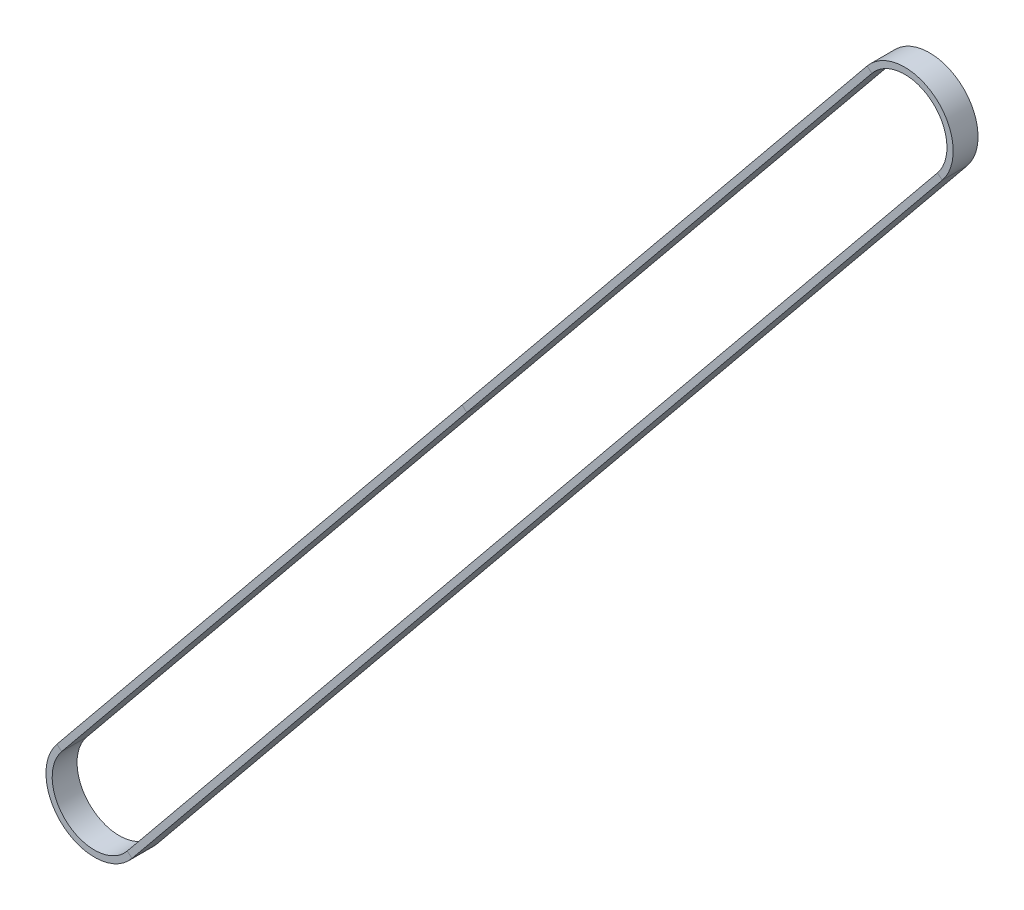
ISO-10303-21;
HEADER;
FILE_DESCRIPTION(('STEP AP214'),'2;1');
FILE_NAME('part.step','',(''),(''),'','','');
FILE_SCHEMA(('AUTOMOTIVE_DESIGN { 1 0 10303 214 1 1 1 1 }'));
ENDSEC;
DATA;
#1=APPLICATION_CONTEXT('core data for automotive mechanical design processes');
#2=APPLICATION_PROTOCOL_DEFINITION('international standard','automotive_design',2000,#1);
#3=PRODUCT_CONTEXT('',#1,'mechanical');
#4=PRODUCT('Part','Part','',(#3));
#5=PRODUCT_RELATED_PRODUCT_CATEGORY('part','',(#4));
#6=PRODUCT_DEFINITION_FORMATION('','',#4);
#7=PRODUCT_DEFINITION_CONTEXT('part definition',#1,'design');
#8=PRODUCT_DEFINITION('design','',#6,#7);
#9=PRODUCT_DEFINITION_SHAPE('','',#8);
#10=(LENGTH_UNIT() NAMED_UNIT(*) SI_UNIT(.MILLI.,.METRE.));
#11=(NAMED_UNIT(*) PLANE_ANGLE_UNIT() SI_UNIT($,.RADIAN.));
#12=(NAMED_UNIT(*) SI_UNIT($,.STERADIAN.) SOLID_ANGLE_UNIT());
#13=UNCERTAINTY_MEASURE_WITH_UNIT(LENGTH_MEASURE(1.E-05),#10,'distance_accuracy_value','');
#14=(GEOMETRIC_REPRESENTATION_CONTEXT(3) GLOBAL_UNCERTAINTY_ASSIGNED_CONTEXT((#13)) GLOBAL_UNIT_ASSIGNED_CONTEXT((#10,
#11,#12)) REPRESENTATION_CONTEXT('',''));
#15=CARTESIAN_POINT('',(0.,0.,0.));
#16=DIRECTION('',(0.,0.,1.));
#17=DIRECTION('',(1.,0.,0.));
#18=AXIS2_PLACEMENT_3D('',#15,#16,#17);
#19=CARTESIAN_POINT('',(-9.06319100841828,7.39922757758679,3.));
#20=DIRECTION('',(0.774631710121228,-0.632412613468977,0.));
#21=DIRECTION('',(0.632412613468977,0.774631710121228,0.));
#22=AXIS2_PLACEMENT_3D('',#19,#20,#21);
#23=PLANE('',#22);
#24=DIRECTION('',(0.,0.,-1.));
#25=VECTOR('',#24,1.);
#26=CARTESIAN_POINT('',(-9.06319100841808,7.39922757758665,3.));
#27=LINE('',#26,#25);
#28=CARTESIAN_POINT('',(-9.06319100841824,7.39922757758678,3.));
#29=VERTEX_POINT('',#28);
#30=CARTESIAN_POINT('',(-9.06319100841824,7.39922757758678,-3.));
#31=VERTEX_POINT('',#30);
#32=EDGE_CURVE('E167',#29,#31,#27,.T.);
#33=ORIENTED_EDGE('',*,*,#32,.F.);
#34=DIRECTION('',(0.632412613468977,0.774631710121228,0.));
#35=VECTOR('',#34,1.);
#36=CARTESIAN_POINT('',(-9.06319100841828,7.39922757758679,3.));
#37=LINE('',#36,#35);
#38=CARTESIAN_POINT('',(88.6807064775247,127.124104739867,3.));
#39=VERTEX_POINT('',#38);
#40=EDGE_CURVE('E166',#29,#39,#37,.T.);
#41=ORIENTED_EDGE('',*,*,#40,.T.);
#42=DIRECTION('',(0.,0.,-1.));
#43=VECTOR('',#42,1.);
#44=CARTESIAN_POINT('',(88.6807064775247,127.124104739867,3.));
#45=LINE('',#44,#43);
#46=CARTESIAN_POINT('',(88.6807064775247,127.124104739867,-3.));
#47=VERTEX_POINT('',#46);
#48=EDGE_CURVE('E141',#39,#47,#45,.T.);
#49=ORIENTED_EDGE('',*,*,#48,.T.);
#50=DIRECTION('',(0.632412613468977,0.774631710121228,0.));
#51=VECTOR('',#50,1.);
#52=CARTESIAN_POINT('',(-9.06319100841828,7.39922757758679,-3.));
#53=LINE('',#52,#51);
#54=EDGE_CURVE('E171',#31,#47,#53,.T.);
#55=ORIENTED_EDGE('',*,*,#54,.F.);
#56=EDGE_LOOP('',(#33,#41,#49,#55));
#57=FACE_BOUND('',#56,.T.);
#58=ADVANCED_FACE('F33',(#57),#23,.F.);
#59=CARTESIAN_POINT('',(88.6807064775247,127.124104739867,3.));
#60=DIRECTION('',(0.774631710121228,-0.632412613468977,0.));
#61=DIRECTION('',(0.632412613468977,0.774631710121228,0.));
#62=AXIS2_PLACEMENT_3D('',#59,#60,#61);
#63=PLANE('',#62);
#64=DIRECTION('',(0.632412613468977,0.774631710121228,0.));
#65=VECTOR('',#64,1.);
#66=CARTESIAN_POINT('',(88.6807064775247,127.124104739867,-3.));
#67=LINE('',#66,#65);
#68=CARTESIAN_POINT('',(186.424603963468,246.848981902148,-3.));
#69=VERTEX_POINT('',#68);
#70=EDGE_CURVE('E147',#47,#69,#67,.T.);
#71=ORIENTED_EDGE('',*,*,#70,.F.);
#72=ORIENTED_EDGE('',*,*,#48,.F.);
#73=DIRECTION('',(0.632412613468977,0.774631710121228,0.));
#74=VECTOR('',#73,1.);
#75=CARTESIAN_POINT('',(88.6807064775247,127.124104739867,3.));
#76=LINE('',#75,#74);
#77=CARTESIAN_POINT('',(186.424603963468,246.848981902148,3.));
#78=VERTEX_POINT('',#77);
#79=EDGE_CURVE('E145',#39,#78,#76,.T.);
#80=ORIENTED_EDGE('',*,*,#79,.T.);
#81=DIRECTION('',(0.,0.,-1.));
#82=VECTOR('',#81,1.);
#83=CARTESIAN_POINT('',(186.424603963468,246.848981902148,3.));
#84=LINE('',#83,#82);
#85=EDGE_CURVE('E163',#78,#69,#84,.T.);
#86=ORIENTED_EDGE('',*,*,#85,.T.);
#87=EDGE_LOOP('',(#71,#72,#80,#86));
#88=FACE_BOUND('',#87,.T.);
#89=ADVANCED_FACE('F143',(#88),#63,.F.);
#90=CARTESIAN_POINT('',(88.6807064775247,127.124104739867,-3.));
#91=DIRECTION('',(0.,0.,1.));
#92=DIRECTION('',(1.,0.,0.));
#93=AXIS2_PLACEMENT_3D('',#90,#91,#92);
#94=PLANE('',#93);
#95=DIRECTION('',(0.632412613468977,0.774631710121228,0.));
#96=VECTOR('',#95,1.);
#97=CARTESIAN_POINT('',(89.8426540427065,126.175485819664,-3.));
#98=LINE('',#97,#96);
#99=CARTESIAN_POINT('',(89.8426540427065,126.175485819664,-3.));
#100=VERTEX_POINT('',#99);
#101=CARTESIAN_POINT('',(187.586551528649,245.900362981944,-3.));
#102=VERTEX_POINT('',#101);
#103=EDGE_CURVE('E212',#100,#102,#98,.T.);
#104=ORIENTED_EDGE('',*,*,#103,.F.);
#105=DIRECTION('',(0.774631710121232,-0.632412613468972,0.));
#106=VECTOR('',#105,1.);
#107=CARTESIAN_POINT('',(88.6807064775247,127.124104739867,-3.));
#108=LINE('',#107,#106);
#109=EDGE_CURVE('E152',#47,#100,#108,.T.);
#110=ORIENTED_EDGE('',*,*,#109,.F.);
#111=ORIENTED_EDGE('',*,*,#70,.T.);
#112=DIRECTION('',(0.774631710121232,-0.632412613468972,0.));
#113=VECTOR('',#112,1.);
#114=CARTESIAN_POINT('',(186.424603963468,246.848981902148,-3.));
#115=LINE('',#114,#113);
#116=EDGE_CURVE('E237',#69,#102,#115,.T.);
#117=ORIENTED_EDGE('',*,*,#116,.T.);
#118=EDGE_LOOP('',(#104,#110,#111,#117));
#119=FACE_BOUND('',#118,.T.);
#120=ADVANCED_FACE('F257',(#119),#94,.F.);
#121=CARTESIAN_POINT('',(89.8426540427065,126.175485819664,3.));
#122=DIRECTION('',(-0.774631710121228,0.632412613468977,0.));
#123=DIRECTION('',(-0.632412613468977,-0.774631710121228,0.));
#124=AXIS2_PLACEMENT_3D('',#121,#122,#123);
#125=PLANE('',#124);
#126=DIRECTION('',(0.632412613468977,0.774631710121228,0.));
#127=VECTOR('',#126,1.);
#128=CARTESIAN_POINT('',(89.8426540427065,126.175485819664,3.));
#129=LINE('',#128,#127);
#130=CARTESIAN_POINT('',(89.8426540427065,126.175485819664,3.));
#131=VERTEX_POINT('',#130);
#132=CARTESIAN_POINT('',(187.586551528649,245.900362981944,3.));
#133=VERTEX_POINT('',#132);
#134=EDGE_CURVE('E182',#131,#133,#129,.T.);
#135=ORIENTED_EDGE('',*,*,#134,.F.);
#136=DIRECTION('',(0.,0.,1.));
#137=VECTOR('',#136,1.);
#138=CARTESIAN_POINT('',(89.8426540427065,126.175485819664,3.));
#139=LINE('',#138,#137);
#140=EDGE_CURVE('E174',#100,#131,#139,.T.);
#141=ORIENTED_EDGE('',*,*,#140,.F.);
#142=ORIENTED_EDGE('',*,*,#103,.T.);
#143=DIRECTION('',(0.,0.,1.));
#144=VECTOR('',#143,1.);
#145=CARTESIAN_POINT('',(187.586551528649,245.900362981944,3.));
#146=LINE('',#145,#144);
#147=EDGE_CURVE('E214',#102,#133,#146,.T.);
#148=ORIENTED_EDGE('',*,*,#147,.T.);
#149=EDGE_LOOP('',(#135,#141,#142,#148));
#150=FACE_BOUND('',#149,.T.);
#151=ADVANCED_FACE('F210',(#150),#125,.F.);
#152=CARTESIAN_POINT('',(88.6807064775247,127.124104739867,3.));
#153=DIRECTION('',(0.,0.,-1.));
#154=DIRECTION('',(-1.,0.,0.));
#155=AXIS2_PLACEMENT_3D('',#152,#153,#154);
#156=PLANE('',#155);
#157=DIRECTION('',(-0.774631710121232,0.632412613468972,0.));
#158=VECTOR('',#157,1.);
#159=CARTESIAN_POINT('',(186.424603963468,246.848981902148,3.));
#160=LINE('',#159,#158);
#161=EDGE_CURVE('E161',#133,#78,#160,.T.);
#162=ORIENTED_EDGE('',*,*,#161,.T.);
#163=ORIENTED_EDGE('',*,*,#79,.F.);
#164=DIRECTION('',(-0.774631710121232,0.632412613468972,0.));
#165=VECTOR('',#164,1.);
#166=CARTESIAN_POINT('',(88.6807064775247,127.124104739867,3.));
#167=LINE('',#166,#165);
#168=EDGE_CURVE('E159',#131,#39,#167,.T.);
#169=ORIENTED_EDGE('',*,*,#168,.F.);
#170=ORIENTED_EDGE('',*,*,#134,.T.);
#171=EDGE_LOOP('',(#162,#163,#169,#170));
#172=FACE_BOUND('',#171,.T.);
#173=ADVANCED_FACE('F157',(#172),#156,.F.);
#174=CARTESIAN_POINT('',(195.487794971886,239.449754324561,0.));
#175=DIRECTION('',(0.,0.,-1.));
#176=DIRECTION('',(-1.,0.,0.));
#177=AXIS2_PLACEMENT_3D('',#174,#175,#176);
#178=CYLINDRICAL_SURFACE('',#177,11.6999999999998);
#179=CARTESIAN_POINT('',(195.487794971886,239.449754324561,-3.));
#180=DIRECTION('',(0.,0.,-1.));
#181=DIRECTION('',(-0.774631710121231,0.632412613468973,0.));
#182=AXIS2_PLACEMENT_3D('',#179,#180,#181);
#183=CIRCLE('',#182,11.6999999999998);
#184=CARTESIAN_POINT('',(204.550985980304,232.050526746974,-3.));
#185=VERTEX_POINT('',#184);
#186=EDGE_CURVE('E126',#69,#185,#183,.T.);
#187=ORIENTED_EDGE('',*,*,#186,.F.);
#188=ORIENTED_EDGE('',*,*,#85,.F.);
#189=CARTESIAN_POINT('',(195.487794971886,239.449754324561,3.));
#190=DIRECTION('',(0.,0.,-1.));
#191=DIRECTION('',(-0.774631710121231,0.632412613468973,0.));
#192=AXIS2_PLACEMENT_3D('',#189,#190,#191);
#193=CIRCLE('',#192,11.6999999999998);
#194=CARTESIAN_POINT('',(204.550985980304,232.050526746974,3.));
#195=VERTEX_POINT('',#194);
#196=EDGE_CURVE('E181',#78,#195,#193,.T.);
#197=ORIENTED_EDGE('',*,*,#196,.T.);
#198=DIRECTION('',(0.,0.,-1.));
#199=VECTOR('',#198,1.);
#200=CARTESIAN_POINT('',(204.550985980304,232.050526746974,3.));
#201=LINE('',#200,#199);
#202=EDGE_CURVE('E242',#195,#185,#201,.T.);
#203=ORIENTED_EDGE('',*,*,#202,.T.);
#204=EDGE_LOOP('',(#187,#188,#197,#203));
#205=FACE_BOUND('',#204,.T.);
#206=ADVANCED_FACE('F282',(#205),#178,.T.);
#207=CARTESIAN_POINT('',(186.424603963468,246.848981902147,-3.));
#208=DIRECTION('',(0.,0.,1.));
#209=DIRECTION('',(1.,0.,0.));
#210=AXIS2_PLACEMENT_3D('',#207,#208,#209);
#211=PLANE('',#210);
#212=CARTESIAN_POINT('',(195.487794971886,239.449754324561,-3.));
#213=DIRECTION('',(0.,0.,-1.));
#214=DIRECTION('',(-0.774631710121231,0.632412613468973,0.));
#215=AXIS2_PLACEMENT_3D('',#212,#213,#214);
#216=CIRCLE('',#215,10.1999999999998);
#217=CARTESIAN_POINT('',(203.389038415122,232.999145667177,-3.));
#218=VERTEX_POINT('',#217);
#219=EDGE_CURVE('E120',#102,#218,#216,.T.);
#220=ORIENTED_EDGE('',*,*,#219,.F.);
#221=ORIENTED_EDGE('',*,*,#116,.F.);
#222=ORIENTED_EDGE('',*,*,#186,.T.);
#223=DIRECTION('',(-0.774631710121236,0.632412613468967,0.));
#224=VECTOR('',#223,1.);
#225=CARTESIAN_POINT('',(204.550985980304,232.050526746974,-3.));
#226=LINE('',#225,#224);
#227=EDGE_CURVE('E219',#185,#218,#226,.T.);
#228=ORIENTED_EDGE('',*,*,#227,.T.);
#229=EDGE_LOOP('',(#220,#221,#222,#228));
#230=FACE_BOUND('',#229,.T.);
#231=ADVANCED_FACE('F284',(#230),#211,.F.);
#232=CARTESIAN_POINT('',(195.487794971886,239.449754324561,0.));
#233=DIRECTION('',(0.,0.,-1.));
#234=DIRECTION('',(-1.,0.,0.));
#235=AXIS2_PLACEMENT_3D('',#232,#233,#234);
#236=CYLINDRICAL_SURFACE('',#235,10.1999999999998);
#237=CARTESIAN_POINT('',(195.487794971886,239.449754324561,3.));
#238=DIRECTION('',(0.,0.,-1.));
#239=DIRECTION('',(-0.774631710121231,0.632412613468973,0.));
#240=AXIS2_PLACEMENT_3D('',#237,#238,#239);
#241=CIRCLE('',#240,10.1999999999998);
#242=CARTESIAN_POINT('',(203.389038415122,232.999145667177,3.));
#243=VERTEX_POINT('',#242);
#244=EDGE_CURVE('E186',#133,#243,#241,.T.);
#245=ORIENTED_EDGE('',*,*,#244,.F.);
#246=ORIENTED_EDGE('',*,*,#147,.F.);
#247=ORIENTED_EDGE('',*,*,#219,.T.);
#248=DIRECTION('',(0.,0.,1.));
#249=VECTOR('',#248,1.);
#250=CARTESIAN_POINT('',(203.389038415123,232.999145667177,3.));
#251=LINE('',#250,#249);
#252=EDGE_CURVE('E218',#218,#243,#251,.T.);
#253=ORIENTED_EDGE('',*,*,#252,.T.);
#254=EDGE_LOOP('',(#245,#246,#247,#253));
#255=FACE_BOUND('',#254,.T.);
#256=ADVANCED_FACE('F290',(#255),#236,.F.);
#257=CARTESIAN_POINT('',(186.424603963468,246.848981902147,3.));
#258=DIRECTION('',(0.,0.,-1.));
#259=DIRECTION('',(-1.,0.,0.));
#260=AXIS2_PLACEMENT_3D('',#257,#258,#259);
#261=PLANE('',#260);
#262=DIRECTION('',(0.774631710121236,-0.632412613468967,0.));
#263=VECTOR('',#262,1.);
#264=CARTESIAN_POINT('',(204.550985980304,232.050526746974,3.));
#265=LINE('',#264,#263);
#266=EDGE_CURVE('E183',#243,#195,#265,.T.);
#267=ORIENTED_EDGE('',*,*,#266,.T.);
#268=ORIENTED_EDGE('',*,*,#196,.F.);
#269=ORIENTED_EDGE('',*,*,#161,.F.);
#270=ORIENTED_EDGE('',*,*,#244,.T.);
#271=EDGE_LOOP('',(#267,#268,#269,#270));
#272=FACE_BOUND('',#271,.T.);
#273=ADVANCED_FACE('F280',(#272),#261,.F.);
#274=CARTESIAN_POINT('',(204.550985980304,232.050526746974,3.));
#275=DIRECTION('',(-0.774631710121228,0.632412613468977,0.));
#276=DIRECTION('',(-0.632412613468977,-0.774631710121228,0.));
#277=AXIS2_PLACEMENT_3D('',#274,#275,#276);
#278=PLANE('',#277);
#279=DIRECTION('',(-0.632412613468977,-0.774631710121228,0.));
#280=VECTOR('',#279,1.);
#281=CARTESIAN_POINT('',(204.550985980304,232.050526746974,-3.));
#282=LINE('',#281,#280);
#283=CARTESIAN_POINT('',(9.06319100841849,-7.39922757758715,-3.));
#284=VERTEX_POINT('',#283);
#285=EDGE_CURVE('E103',#185,#284,#282,.T.);
#286=ORIENTED_EDGE('',*,*,#285,.F.);
#287=ORIENTED_EDGE('',*,*,#202,.F.);
#288=DIRECTION('',(-0.632412613468977,-0.774631710121228,0.));
#289=VECTOR('',#288,1.);
#290=CARTESIAN_POINT('',(204.550985980304,232.050526746974,3.));
#291=LINE('',#290,#289);
#292=CARTESIAN_POINT('',(9.06319100841849,-7.39922757758715,3.));
#293=VERTEX_POINT('',#292);
#294=EDGE_CURVE('E185',#195,#293,#291,.T.);
#295=ORIENTED_EDGE('',*,*,#294,.T.);
#296=DIRECTION('',(0.,0.,-1.));
#297=VECTOR('',#296,1.);
#298=CARTESIAN_POINT('',(9.06319100841853,-7.39922757758713,3.));
#299=LINE('',#298,#297);
#300=EDGE_CURVE('E195',#293,#284,#299,.T.);
#301=ORIENTED_EDGE('',*,*,#300,.T.);
#302=EDGE_LOOP('',(#286,#287,#295,#301));
#303=FACE_BOUND('',#302,.T.);
#304=ADVANCED_FACE('F276',(#303),#278,.F.);
#305=CARTESIAN_POINT('',(204.550985980304,232.050526746974,-3.));
#306=DIRECTION('',(0.,0.,1.));
#307=DIRECTION('',(1.,0.,0.));
#308=AXIS2_PLACEMENT_3D('',#305,#306,#307);
#309=PLANE('',#308);
#310=DIRECTION('',(-0.632412613468977,-0.774631710121228,0.));
#311=VECTOR('',#310,1.);
#312=CARTESIAN_POINT('',(203.389038415123,232.999145667177,-3.));
#313=LINE('',#312,#311);
#314=CARTESIAN_POINT('',(7.90124344323664,-6.4506086573837,-3.));
#315=VERTEX_POINT('',#314);
#316=EDGE_CURVE('E96',#218,#315,#313,.T.);
#317=ORIENTED_EDGE('',*,*,#316,.F.);
#318=ORIENTED_EDGE('',*,*,#227,.F.);
#319=ORIENTED_EDGE('',*,*,#285,.T.);
#320=DIRECTION('',(-0.774631710121232,0.632412613468972,0.));
#321=VECTOR('',#320,1.);
#322=CARTESIAN_POINT('',(9.06319100841853,-7.39922757758713,-3.));
#323=LINE('',#322,#321);
#324=EDGE_CURVE('E193',#284,#315,#323,.T.);
#325=ORIENTED_EDGE('',*,*,#324,.T.);
#326=EDGE_LOOP('',(#317,#318,#319,#325));
#327=FACE_BOUND('',#326,.T.);
#328=ADVANCED_FACE('F279',(#327),#309,.F.);
#329=CARTESIAN_POINT('',(203.389038415123,232.999145667177,3.));
#330=DIRECTION('',(0.774631710121228,-0.632412613468977,0.));
#331=DIRECTION('',(0.632412613468977,0.774631710121228,0.));
#332=AXIS2_PLACEMENT_3D('',#329,#330,#331);
#333=PLANE('',#332);
#334=DIRECTION('',(-0.632412613468977,-0.774631710121228,0.));
#335=VECTOR('',#334,1.);
#336=CARTESIAN_POINT('',(203.389038415123,232.999145667177,3.));
#337=LINE('',#336,#335);
#338=CARTESIAN_POINT('',(7.90124344323664,-6.4506086573837,3.));
#339=VERTEX_POINT('',#338);
#340=EDGE_CURVE('E87',#243,#339,#337,.T.);
#341=ORIENTED_EDGE('',*,*,#340,.F.);
#342=ORIENTED_EDGE('',*,*,#252,.F.);
#343=ORIENTED_EDGE('',*,*,#316,.T.);
#344=DIRECTION('',(0.,0.,1.));
#345=VECTOR('',#344,1.);
#346=CARTESIAN_POINT('',(7.90124344323669,-6.45060865738367,3.));
#347=LINE('',#346,#345);
#348=EDGE_CURVE('E189',#315,#339,#347,.T.);
#349=ORIENTED_EDGE('',*,*,#348,.T.);
#350=EDGE_LOOP('',(#341,#342,#343,#349));
#351=FACE_BOUND('',#350,.T.);
#352=ADVANCED_FACE('F294',(#351),#333,.F.);
#353=CARTESIAN_POINT('',(204.550985980304,232.050526746974,3.));
#354=DIRECTION('',(0.,0.,-1.));
#355=DIRECTION('',(-1.,0.,0.));
#356=AXIS2_PLACEMENT_3D('',#353,#354,#355);
#357=PLANE('',#356);
#358=DIRECTION('',(0.774631710121232,-0.632412613468972,0.));
#359=VECTOR('',#358,1.);
#360=CARTESIAN_POINT('',(9.06319100841853,-7.39922757758713,3.));
#361=LINE('',#360,#359);
#362=EDGE_CURVE('E187',#339,#293,#361,.T.);
#363=ORIENTED_EDGE('',*,*,#362,.T.);
#364=ORIENTED_EDGE('',*,*,#294,.F.);
#365=ORIENTED_EDGE('',*,*,#266,.F.);
#366=ORIENTED_EDGE('',*,*,#340,.T.);
#367=EDGE_LOOP('',(#363,#364,#365,#366));
#368=FACE_BOUND('',#367,.T.);
#369=ADVANCED_FACE('F275',(#368),#357,.F.);
#370=CARTESIAN_POINT('',(1.38871193523689E-13,-1.66629599796326E-13,0.));
#371=DIRECTION('',(0.,0.,-1.));
#372=DIRECTION('',(-1.,0.,0.));
#373=AXIS2_PLACEMENT_3D('',#370,#371,#372);
#374=CYLINDRICAL_SURFACE('',#373,11.7);
#375=CARTESIAN_POINT('',(1.38871193523689E-13,-1.66629599796326E-13,-3.));
#376=DIRECTION('',(0.,0.,-1.));
#377=DIRECTION('',(0.774631710121231,-0.632412613468973,0.));
#378=AXIS2_PLACEMENT_3D('',#375,#376,#377);
#379=CIRCLE('',#378,11.7);
#380=EDGE_CURVE('E227',#284,#31,#379,.T.);
#381=ORIENTED_EDGE('',*,*,#380,.F.);
#382=ORIENTED_EDGE('',*,*,#300,.F.);
#383=CARTESIAN_POINT('',(1.38871193523689E-13,-1.66629599796326E-13,3.));
#384=DIRECTION('',(0.,0.,-1.));
#385=DIRECTION('',(0.774631710121231,-0.632412613468973,0.));
#386=AXIS2_PLACEMENT_3D('',#383,#384,#385);
#387=CIRCLE('',#386,11.7);
#388=EDGE_CURVE('E188',#293,#29,#387,.T.);
#389=ORIENTED_EDGE('',*,*,#388,.T.);
#390=ORIENTED_EDGE('',*,*,#32,.T.);
#391=EDGE_LOOP('',(#381,#382,#389,#390));
#392=FACE_BOUND('',#391,.T.);
#393=ADVANCED_FACE('F272',(#392),#374,.T.);
#394=CARTESIAN_POINT('',(9.06319100841851,-7.39922757758713,-3.));
#395=DIRECTION('',(0.,0.,1.));
#396=DIRECTION('',(1.,0.,0.));
#397=AXIS2_PLACEMENT_3D('',#394,#395,#396);
#398=PLANE('',#397);
#399=CARTESIAN_POINT('',(1.38871193523689E-13,-1.66629599796326E-13,-3.));
#400=DIRECTION('',(0.,0.,-1.));
#401=DIRECTION('',(0.774631710121231,-0.632412613468973,0.));
#402=AXIS2_PLACEMENT_3D('',#399,#400,#401);
#403=CIRCLE('',#402,10.2);
#404=CARTESIAN_POINT('',(-7.9012434432364,6.45060865738333,-3.));
#405=VERTEX_POINT('',#404);
#406=EDGE_CURVE('E58',#315,#405,#403,.T.);
#407=ORIENTED_EDGE('',*,*,#406,.F.);
#408=ORIENTED_EDGE('',*,*,#324,.F.);
#409=ORIENTED_EDGE('',*,*,#380,.T.);
#410=DIRECTION('',(0.774631710121232,-0.632412613468972,0.));
#411=VECTOR('',#410,1.);
#412=CARTESIAN_POINT('',(-9.06319100841808,7.39922757758665,-3.));
#413=LINE('',#412,#411);
#414=EDGE_CURVE('E225',#31,#405,#413,.T.);
#415=ORIENTED_EDGE('',*,*,#414,.T.);
#416=EDGE_LOOP('',(#407,#408,#409,#415));
#417=FACE_BOUND('',#416,.T.);
#418=ADVANCED_FACE('F253',(#417),#398,.F.);
#419=CARTESIAN_POINT('',(1.38871193523689E-13,-1.66629599796326E-13,0.));
#420=DIRECTION('',(0.,0.,-1.));
#421=DIRECTION('',(-1.,0.,0.));
#422=AXIS2_PLACEMENT_3D('',#419,#420,#421);
#423=CYLINDRICAL_SURFACE('',#422,10.2);
#424=CARTESIAN_POINT('',(1.38871193523689E-13,-1.66629599796326E-13,3.));
#425=DIRECTION('',(0.,0.,-1.));
#426=DIRECTION('',(0.774631710121231,-0.632412613468973,0.));
#427=AXIS2_PLACEMENT_3D('',#424,#425,#426);
#428=CIRCLE('',#427,10.2);
#429=CARTESIAN_POINT('',(-7.9012434432364,6.45060865738333,3.));
#430=VERTEX_POINT('',#429);
#431=EDGE_CURVE('E50',#339,#430,#428,.T.);
#432=ORIENTED_EDGE('',*,*,#431,.F.);
#433=ORIENTED_EDGE('',*,*,#348,.F.);
#434=ORIENTED_EDGE('',*,*,#406,.T.);
#435=DIRECTION('',(0.,0.,1.));
#436=VECTOR('',#435,1.);
#437=CARTESIAN_POINT('',(-7.90124344323624,6.4506086573832,3.));
#438=LINE('',#437,#436);
#439=EDGE_CURVE('E201',#405,#430,#438,.T.);
#440=ORIENTED_EDGE('',*,*,#439,.T.);
#441=EDGE_LOOP('',(#432,#433,#434,#440));
#442=FACE_BOUND('',#441,.T.);
#443=ADVANCED_FACE('F303',(#442),#423,.F.);
#444=CARTESIAN_POINT('',(9.06319100841851,-7.39922757758713,3.));
#445=DIRECTION('',(0.,0.,-1.));
#446=DIRECTION('',(-1.,0.,0.));
#447=AXIS2_PLACEMENT_3D('',#444,#445,#446);
#448=PLANE('',#447);
#449=DIRECTION('',(-0.774631710121232,0.632412613468972,0.));
#450=VECTOR('',#449,1.);
#451=CARTESIAN_POINT('',(-9.06319100841808,7.39922757758665,3.));
#452=LINE('',#451,#450);
#453=EDGE_CURVE('E37',#430,#29,#452,.T.);
#454=ORIENTED_EDGE('',*,*,#453,.T.);
#455=ORIENTED_EDGE('',*,*,#388,.F.);
#456=ORIENTED_EDGE('',*,*,#362,.F.);
#457=ORIENTED_EDGE('',*,*,#431,.T.);
#458=EDGE_LOOP('',(#454,#455,#456,#457));
#459=FACE_BOUND('',#458,.T.);
#460=ADVANCED_FACE('F202',(#459),#448,.F.);
#461=CARTESIAN_POINT('',(-9.06319100841828,7.39922757758679,-3.));
#462=DIRECTION('',(0.,0.,1.));
#463=DIRECTION('',(1.,0.,0.));
#464=AXIS2_PLACEMENT_3D('',#461,#462,#463);
#465=PLANE('',#464);
#466=ORIENTED_EDGE('',*,*,#54,.T.);
#467=ORIENTED_EDGE('',*,*,#109,.T.);
#468=DIRECTION('',(0.632412613468977,0.774631710121228,0.));
#469=VECTOR('',#468,1.);
#470=CARTESIAN_POINT('',(-7.90124344323644,6.45060865738334,-3.));
#471=LINE('',#470,#469);
#472=EDGE_CURVE('E42',#405,#100,#471,.T.);
#473=ORIENTED_EDGE('',*,*,#472,.F.);
#474=ORIENTED_EDGE('',*,*,#414,.F.);
#475=EDGE_LOOP('',(#466,#467,#473,#474));
#476=FACE_BOUND('',#475,.T.);
#477=ADVANCED_FACE('F256',(#476),#465,.F.);
#478=CARTESIAN_POINT('',(-7.90124344323644,6.45060865738334,3.));
#479=DIRECTION('',(-0.774631710121228,0.632412613468977,0.));
#480=DIRECTION('',(-0.632412613468977,-0.774631710121228,0.));
#481=AXIS2_PLACEMENT_3D('',#478,#479,#480);
#482=PLANE('',#481);
#483=ORIENTED_EDGE('',*,*,#472,.T.);
#484=ORIENTED_EDGE('',*,*,#140,.T.);
#485=DIRECTION('',(0.632412613468977,0.774631710121228,0.));
#486=VECTOR('',#485,1.);
#487=CARTESIAN_POINT('',(-7.90124344323644,6.45060865738334,3.));
#488=LINE('',#487,#486);
#489=EDGE_CURVE('E11',#430,#131,#488,.T.);
#490=ORIENTED_EDGE('',*,*,#489,.F.);
#491=ORIENTED_EDGE('',*,*,#439,.F.);
#492=EDGE_LOOP('',(#483,#484,#490,#491));
#493=FACE_BOUND('',#492,.T.);
#494=ADVANCED_FACE('F206',(#493),#482,.F.);
#495=CARTESIAN_POINT('',(-9.06319100841828,7.39922757758679,3.));
#496=DIRECTION('',(0.,0.,-1.));
#497=DIRECTION('',(-1.,0.,0.));
#498=AXIS2_PLACEMENT_3D('',#495,#496,#497);
#499=PLANE('',#498);
#500=ORIENTED_EDGE('',*,*,#489,.T.);
#501=ORIENTED_EDGE('',*,*,#168,.T.);
#502=ORIENTED_EDGE('',*,*,#40,.F.);
#503=ORIENTED_EDGE('',*,*,#453,.F.);
#504=EDGE_LOOP('',(#500,#501,#502,#503));
#505=FACE_BOUND('',#504,.T.);
#506=ADVANCED_FACE('F35',(#505),#499,.F.);
#507=CLOSED_SHELL('',(#58,#89,#120,#151,#173,#206,#231,#256,#273,#304,#328,#352,#369,#393,#418,
#443,#460,#477,#494,#506));
#508=MANIFOLD_SOLID_BREP('B2',#507);
#509=ADVANCED_BREP_SHAPE_REPRESENTATION('',(#18,#508),#14);
#510=SHAPE_DEFINITION_REPRESENTATION(#9,#509);
ENDSEC;
END-ISO-10303-21;
